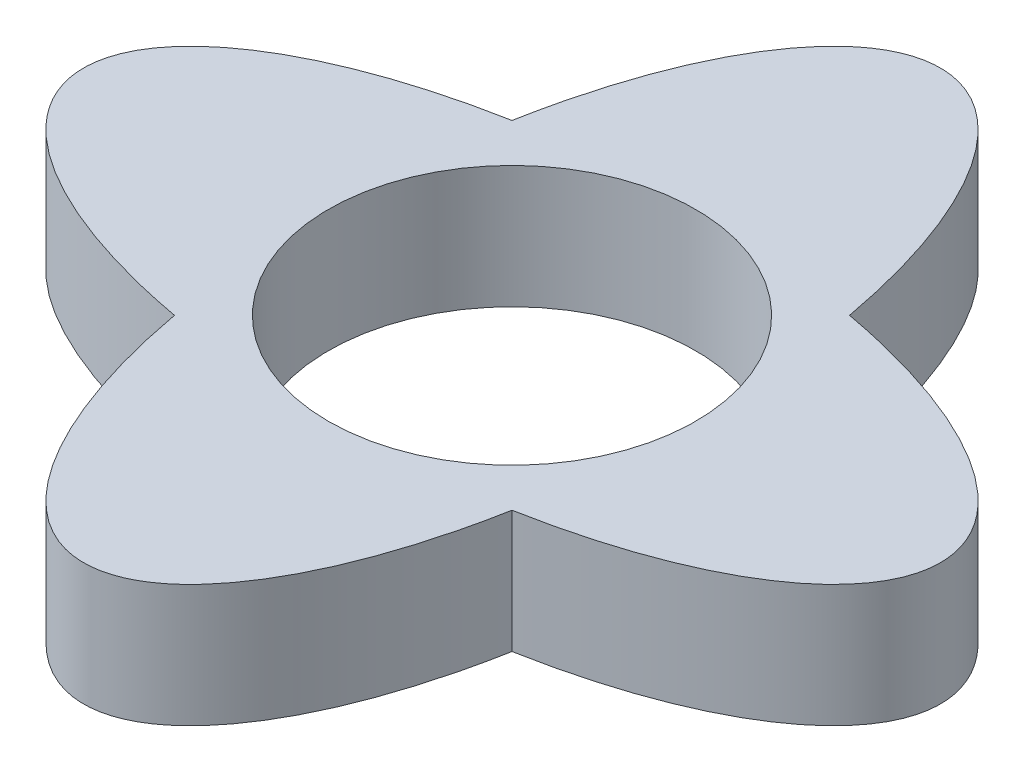
ISO-10303-21;
HEADER;
FILE_DESCRIPTION(('STEP AP214'),'2;1');
FILE_NAME('part.step','',(''),(''),'','','');
FILE_SCHEMA(('AUTOMOTIVE_DESIGN { 1 0 10303 214 1 1 1 1 }'));
ENDSEC;
DATA;
#1=APPLICATION_CONTEXT('core data for automotive mechanical design processes');
#2=APPLICATION_PROTOCOL_DEFINITION('international standard','automotive_design',2000,#1);
#3=PRODUCT_CONTEXT('',#1,'mechanical');
#4=PRODUCT('Part','Part','',(#3));
#5=PRODUCT_RELATED_PRODUCT_CATEGORY('part','',(#4));
#6=PRODUCT_DEFINITION_FORMATION('','',#4);
#7=PRODUCT_DEFINITION_CONTEXT('part definition',#1,'design');
#8=PRODUCT_DEFINITION('design','',#6,#7);
#9=PRODUCT_DEFINITION_SHAPE('','',#8);
#10=(LENGTH_UNIT() NAMED_UNIT(*) SI_UNIT(.MILLI.,.METRE.));
#11=(NAMED_UNIT(*) PLANE_ANGLE_UNIT() SI_UNIT($,.RADIAN.));
#12=(NAMED_UNIT(*) SI_UNIT($,.STERADIAN.) SOLID_ANGLE_UNIT());
#13=UNCERTAINTY_MEASURE_WITH_UNIT(LENGTH_MEASURE(1.E-05),#10,'distance_accuracy_value','');
#14=(GEOMETRIC_REPRESENTATION_CONTEXT(3) GLOBAL_UNCERTAINTY_ASSIGNED_CONTEXT((#13)) GLOBAL_UNIT_ASSIGNED_CONTEXT((#10,
#11,#12)) REPRESENTATION_CONTEXT('',''));
#15=CARTESIAN_POINT('',(0.,0.,0.));
#16=DIRECTION('',(0.,0.,1.));
#17=DIRECTION('',(1.,0.,0.));
#18=AXIS2_PLACEMENT_3D('',#15,#16,#17);
#19=CARTESIAN_POINT('',(0.,2.,0.));
#20=DIRECTION('',(0.,1.,0.));
#21=DIRECTION('',(0.,0.,1.));
#22=AXIS2_PLACEMENT_3D('',#19,#20,#21);
#23=PLANE('',#22);
#24=CARTESIAN_POINT('',(0.,2.,0.));
#25=DIRECTION('',(0.,1.,0.));
#26=DIRECTION('',(0.,0.,-1.));
#27=AXIS2_PLACEMENT_3D('',#24,#25,#26);
#28=ELLIPSE('',#27,7.,3.);
#29=CARTESIAN_POINT('',(2.75743509005418,2.,-2.75743509005417));
#30=VERTEX_POINT('',#29);
#31=CARTESIAN_POINT('',(-2.75743509005417,2.,-2.75743509005418));
#32=VERTEX_POINT('',#31);
#33=EDGE_CURVE('E86',#30,#32,#28,.T.);
#34=ORIENTED_EDGE('',*,*,#33,.T.);
#35=CARTESIAN_POINT('',(0.,2.,0.));
#36=DIRECTION('',(0.,1.,0.));
#37=DIRECTION('',(1.,0.,0.));
#38=AXIS2_PLACEMENT_3D('',#35,#36,#37);
#39=ELLIPSE('',#38,7.,3.);
#40=CARTESIAN_POINT('',(-2.75743509005417,2.,2.75743509005417));
#41=VERTEX_POINT('',#40);
#42=EDGE_CURVE('E81',#32,#41,#39,.T.);
#43=ORIENTED_EDGE('',*,*,#42,.T.);
#44=CARTESIAN_POINT('',(0.,2.,0.));
#45=DIRECTION('',(0.,1.,0.));
#46=DIRECTION('',(0.,0.,-1.));
#47=AXIS2_PLACEMENT_3D('',#44,#45,#46);
#48=ELLIPSE('',#47,7.,3.);
#49=CARTESIAN_POINT('',(2.75743509005417,2.,2.75743509005418));
#50=VERTEX_POINT('',#49);
#51=EDGE_CURVE('E84',#41,#50,#48,.T.);
#52=ORIENTED_EDGE('',*,*,#51,.T.);
#53=CARTESIAN_POINT('',(0.,2.,0.));
#54=DIRECTION('',(0.,1.,0.));
#55=DIRECTION('',(1.,0.,0.));
#56=AXIS2_PLACEMENT_3D('',#53,#54,#55);
#57=ELLIPSE('',#56,7.,3.);
#58=EDGE_CURVE('E51',#50,#30,#57,.T.);
#59=ORIENTED_EDGE('',*,*,#58,.T.);
#60=EDGE_LOOP('',(#34,#43,#52,#59));
#61=FACE_BOUND('',#60,.T.);
#62=CARTESIAN_POINT('',(0.,2.,0.));
#63=DIRECTION('',(0.,1.,0.));
#64=DIRECTION('',(0.,0.,1.));
#65=AXIS2_PLACEMENT_3D('',#62,#63,#64);
#66=CIRCLE('',#65,3.);
#67=CARTESIAN_POINT('',(0.,2.,3.));
#68=VERTEX_POINT('',#67);
#69=EDGE_CURVE('E127',#68,#68,#66,.T.);
#70=ORIENTED_EDGE('',*,*,#69,.F.);
#71=EDGE_LOOP('',(#70));
#72=FACE_BOUND('',#71,.T.);
#73=ADVANCED_FACE('F33',(#61,#72),#23,.T.);
#74=CARTESIAN_POINT('',(0.,0.,0.));
#75=DIRECTION('',(0.,1.,0.));
#76=DIRECTION('',(0.,0.,1.));
#77=AXIS2_PLACEMENT_3D('',#74,#75,#76);
#78=PLANE('',#77);
#79=CARTESIAN_POINT('',(0.,0.,0.));
#80=DIRECTION('',(0.,1.,0.));
#81=DIRECTION('',(0.,0.,-1.));
#82=AXIS2_PLACEMENT_3D('',#79,#80,#81);
#83=ELLIPSE('',#82,7.,3.);
#84=CARTESIAN_POINT('',(2.75743509005418,0.,-2.75743509005417));
#85=VERTEX_POINT('',#84);
#86=CARTESIAN_POINT('',(-2.75743509005417,0.,-2.75743509005418));
#87=VERTEX_POINT('',#86);
#88=EDGE_CURVE('E133',#85,#87,#83,.T.);
#89=ORIENTED_EDGE('',*,*,#88,.F.);
#90=CARTESIAN_POINT('',(0.,0.,0.));
#91=DIRECTION('',(0.,1.,0.));
#92=DIRECTION('',(1.,0.,0.));
#93=AXIS2_PLACEMENT_3D('',#90,#91,#92);
#94=ELLIPSE('',#93,7.,3.);
#95=CARTESIAN_POINT('',(2.75743509005417,0.,2.75743509005418));
#96=VERTEX_POINT('',#95);
#97=EDGE_CURVE('E74',#96,#85,#94,.T.);
#98=ORIENTED_EDGE('',*,*,#97,.F.);
#99=CARTESIAN_POINT('',(0.,0.,0.));
#100=DIRECTION('',(0.,1.,0.));
#101=DIRECTION('',(0.,0.,-1.));
#102=AXIS2_PLACEMENT_3D('',#99,#100,#101);
#103=ELLIPSE('',#102,7.,3.);
#104=CARTESIAN_POINT('',(-2.75743509005417,0.,2.75743509005417));
#105=VERTEX_POINT('',#104);
#106=EDGE_CURVE('E68',#105,#96,#103,.T.);
#107=ORIENTED_EDGE('',*,*,#106,.F.);
#108=CARTESIAN_POINT('',(0.,0.,0.));
#109=DIRECTION('',(0.,1.,0.));
#110=DIRECTION('',(1.,0.,0.));
#111=AXIS2_PLACEMENT_3D('',#108,#109,#110);
#112=ELLIPSE('',#111,7.,3.);
#113=EDGE_CURVE('E90',#87,#105,#112,.T.);
#114=ORIENTED_EDGE('',*,*,#113,.F.);
#115=EDGE_LOOP('',(#89,#98,#107,#114));
#116=FACE_BOUND('',#115,.T.);
#117=CARTESIAN_POINT('',(0.,0.,0.));
#118=DIRECTION('',(0.,1.,0.));
#119=DIRECTION('',(0.,0.,1.));
#120=AXIS2_PLACEMENT_3D('',#117,#118,#119);
#121=CIRCLE('',#120,3.);
#122=CARTESIAN_POINT('',(0.,0.,3.));
#123=VERTEX_POINT('',#122);
#124=EDGE_CURVE('E130',#123,#123,#121,.T.);
#125=ORIENTED_EDGE('',*,*,#124,.T.);
#126=EDGE_LOOP('',(#125));
#127=FACE_BOUND('',#126,.T.);
#128=ADVANCED_FACE('F109',(#116,#127),#78,.F.);
#129=DIRECTION('',(0.,-1.,0.));
#130=VECTOR('',#129,1.);
#131=SURFACE_OF_LINEAR_EXTRUSION('',#28,#130);
#132=ORIENTED_EDGE('',*,*,#88,.T.);
#133=DIRECTION('',(0.,-1.,0.));
#134=VECTOR('',#133,1.);
#135=CARTESIAN_POINT('',(-2.75743509005417,2.,-2.75743509005418));
#136=LINE('',#135,#134);
#137=EDGE_CURVE('E11',#32,#87,#136,.T.);
#138=ORIENTED_EDGE('',*,*,#137,.F.);
#139=ORIENTED_EDGE('',*,*,#33,.F.);
#140=DIRECTION('',(0.,-1.,0.));
#141=VECTOR('',#140,1.);
#142=CARTESIAN_POINT('',(2.75743509005418,2.,-2.75743509005417));
#143=LINE('',#142,#141);
#144=EDGE_CURVE('E94',#30,#85,#143,.T.);
#145=ORIENTED_EDGE('',*,*,#144,.T.);
#146=EDGE_LOOP('',(#132,#138,#139,#145));
#147=FACE_BOUND('',#146,.T.);
#148=ADVANCED_FACE('F35',(#147),#131,.F.);
#149=DIRECTION('',(0.,-1.,0.));
#150=VECTOR('',#149,1.);
#151=SURFACE_OF_LINEAR_EXTRUSION('',#39,#150);
#152=ORIENTED_EDGE('',*,*,#113,.T.);
#153=DIRECTION('',(0.,-1.,0.));
#154=VECTOR('',#153,1.);
#155=CARTESIAN_POINT('',(-2.75743509005417,2.,2.75743509005417));
#156=LINE('',#155,#154);
#157=EDGE_CURVE('E43',#41,#105,#156,.T.);
#158=ORIENTED_EDGE('',*,*,#157,.F.);
#159=ORIENTED_EDGE('',*,*,#42,.F.);
#160=ORIENTED_EDGE('',*,*,#137,.T.);
#161=EDGE_LOOP('',(#152,#158,#159,#160));
#162=FACE_BOUND('',#161,.T.);
#163=ADVANCED_FACE('F89',(#162),#151,.F.);
#164=DIRECTION('',(0.,-1.,0.));
#165=VECTOR('',#164,1.);
#166=SURFACE_OF_LINEAR_EXTRUSION('',#48,#165);
#167=ORIENTED_EDGE('',*,*,#106,.T.);
#168=DIRECTION('',(0.,-1.,0.));
#169=VECTOR('',#168,1.);
#170=CARTESIAN_POINT('',(2.75743509005417,2.,2.75743509005418));
#171=LINE('',#170,#169);
#172=EDGE_CURVE('E91',#50,#96,#171,.T.);
#173=ORIENTED_EDGE('',*,*,#172,.F.);
#174=ORIENTED_EDGE('',*,*,#51,.F.);
#175=ORIENTED_EDGE('',*,*,#157,.T.);
#176=EDGE_LOOP('',(#167,#173,#174,#175));
#177=FACE_BOUND('',#176,.T.);
#178=ADVANCED_FACE('F92',(#177),#166,.F.);
#179=DIRECTION('',(0.,-1.,0.));
#180=VECTOR('',#179,1.);
#181=SURFACE_OF_LINEAR_EXTRUSION('',#57,#180);
#182=ORIENTED_EDGE('',*,*,#97,.T.);
#183=ORIENTED_EDGE('',*,*,#144,.F.);
#184=ORIENTED_EDGE('',*,*,#58,.F.);
#185=ORIENTED_EDGE('',*,*,#172,.T.);
#186=EDGE_LOOP('',(#182,#183,#184,#185));
#187=FACE_BOUND('',#186,.T.);
#188=ADVANCED_FACE('F103',(#187),#181,.F.);
#189=CARTESIAN_POINT('',(0.,2.,0.));
#190=DIRECTION('',(0.,-1.,0.));
#191=DIRECTION('',(0.,0.,-1.));
#192=AXIS2_PLACEMENT_3D('',#189,#190,#191);
#193=CYLINDRICAL_SURFACE('',#192,3.);
#194=ORIENTED_EDGE('',*,*,#69,.T.);
#195=EDGE_LOOP('',(#194));
#196=FACE_BOUND('',#195,.T.);
#197=ORIENTED_EDGE('',*,*,#124,.F.);
#198=EDGE_LOOP('',(#197));
#199=FACE_BOUND('',#198,.T.);
#200=ADVANCED_FACE('F118',(#196,#199),#193,.F.);
#201=CLOSED_SHELL('',(#73,#128,#148,#163,#178,#188,#200));
#202=MANIFOLD_SOLID_BREP('B2',#201);
#203=ADVANCED_BREP_SHAPE_REPRESENTATION('',(#18,#202),#14);
#204=SHAPE_DEFINITION_REPRESENTATION(#9,#203);
ENDSEC;
END-ISO-10303-21;
